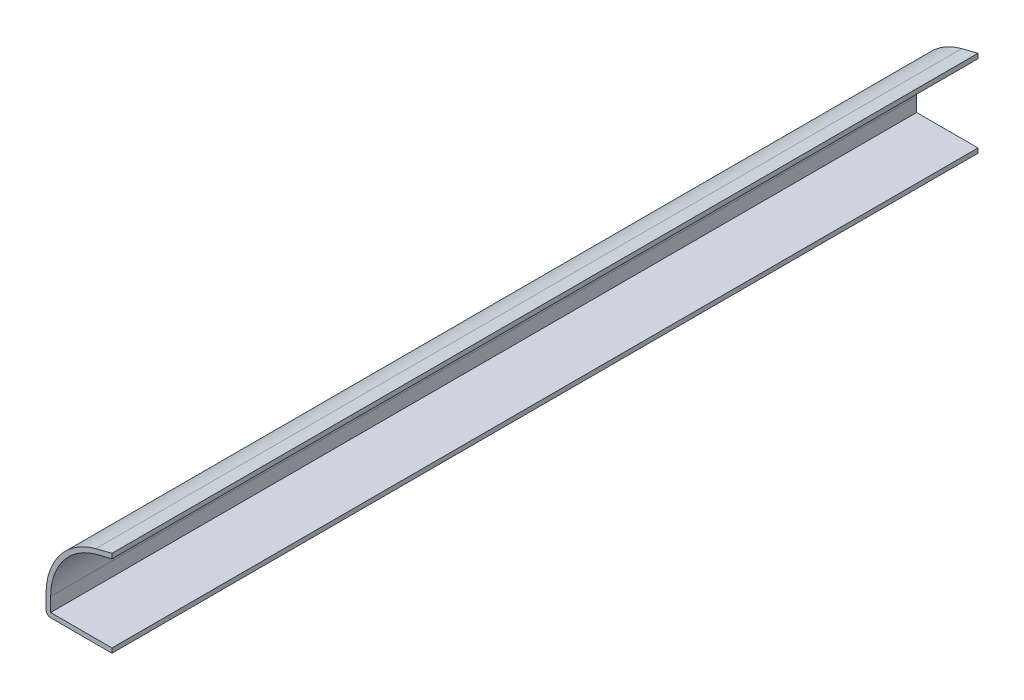
ISO-10303-21;
HEADER;
FILE_DESCRIPTION(('STEP AP214'),'2;1');
FILE_NAME('part.step','',(''),(''),'','','');
FILE_SCHEMA(('AUTOMOTIVE_DESIGN { 1 0 10303 214 1 1 1 1 }'));
ENDSEC;
DATA;
#1=APPLICATION_CONTEXT('core data for automotive mechanical design processes');
#2=APPLICATION_PROTOCOL_DEFINITION('international standard','automotive_design',2000,#1);
#3=PRODUCT_CONTEXT('',#1,'mechanical');
#4=PRODUCT('Part','Part','',(#3));
#5=PRODUCT_RELATED_PRODUCT_CATEGORY('part','',(#4));
#6=PRODUCT_DEFINITION_FORMATION('','',#4);
#7=PRODUCT_DEFINITION_CONTEXT('part definition',#1,'design');
#8=PRODUCT_DEFINITION('design','',#6,#7);
#9=PRODUCT_DEFINITION_SHAPE('','',#8);
#10=(LENGTH_UNIT() NAMED_UNIT(*) SI_UNIT(.MILLI.,.METRE.));
#11=(NAMED_UNIT(*) PLANE_ANGLE_UNIT() SI_UNIT($,.RADIAN.));
#12=(NAMED_UNIT(*) SI_UNIT($,.STERADIAN.) SOLID_ANGLE_UNIT());
#13=UNCERTAINTY_MEASURE_WITH_UNIT(LENGTH_MEASURE(1.E-05),#10,'distance_accuracy_value','');
#14=(GEOMETRIC_REPRESENTATION_CONTEXT(3) GLOBAL_UNCERTAINTY_ASSIGNED_CONTEXT((#13)) GLOBAL_UNIT_ASSIGNED_CONTEXT((#10,
#11,#12)) REPRESENTATION_CONTEXT('',''));
#15=CARTESIAN_POINT('',(0.,0.,0.));
#16=DIRECTION('',(0.,0.,1.));
#17=DIRECTION('',(1.,0.,0.));
#18=AXIS2_PLACEMENT_3D('',#15,#16,#17);
#19=CARTESIAN_POINT('',(-12.7,0.,-166.6875));
#20=DIRECTION('',(0.,-1.,0.));
#21=DIRECTION('',(0.,0.,-1.));
#22=AXIS2_PLACEMENT_3D('',#19,#20,#21);
#23=PLANE('',#22);
#24=DIRECTION('',(1.,0.,0.));
#25=VECTOR('',#24,1.);
#26=CARTESIAN_POINT('',(-12.7,0.,0.));
#27=LINE('',#26,#25);
#28=CARTESIAN_POINT('',(-11.811,0.,0.));
#29=VERTEX_POINT('',#28);
#30=CARTESIAN_POINT('',(0.,0.,0.));
#31=VERTEX_POINT('',#30);
#32=EDGE_CURVE('E187',#29,#31,#27,.T.);
#33=ORIENTED_EDGE('',*,*,#32,.F.);
#34=DIRECTION('',(0.,0.,1.));
#35=VECTOR('',#34,1.);
#36=CARTESIAN_POINT('',(-11.811,0.,-166.6875));
#37=LINE('',#36,#35);
#38=CARTESIAN_POINT('',(-11.811,0.,-166.6875));
#39=VERTEX_POINT('',#38);
#40=EDGE_CURVE('E60',#29,#39,#37,.F.);
#41=ORIENTED_EDGE('',*,*,#40,.T.);
#42=DIRECTION('',(1.,0.,0.));
#43=VECTOR('',#42,1.);
#44=CARTESIAN_POINT('',(-12.7,0.,-166.6875));
#45=LINE('',#44,#43);
#46=CARTESIAN_POINT('',(0.,0.,-166.6875));
#47=VERTEX_POINT('',#46);
#48=EDGE_CURVE('E176',#39,#47,#45,.T.);
#49=ORIENTED_EDGE('',*,*,#48,.T.);
#50=DIRECTION('',(0.,0.,1.));
#51=VECTOR('',#50,1.);
#52=CARTESIAN_POINT('',(0.,0.,-166.6875));
#53=LINE('',#52,#51);
#54=EDGE_CURVE('E161',#47,#31,#53,.T.);
#55=ORIENTED_EDGE('',*,*,#54,.T.);
#56=EDGE_LOOP('',(#33,#41,#49,#55));
#57=FACE_BOUND('',#56,.T.);
#58=ADVANCED_FACE('F37',(#57),#23,.T.);
#59=CARTESIAN_POINT('',(-12.7,0.,-166.6875));
#60=DIRECTION('',(-1.,0.,0.));
#61=DIRECTION('',(0.,0.,1.));
#62=AXIS2_PLACEMENT_3D('',#59,#60,#61);
#63=PLANE('',#62);
#64=DIRECTION('',(0.,-1.,0.));
#65=VECTOR('',#64,1.);
#66=CARTESIAN_POINT('',(-12.7,0.,-166.6875));
#67=LINE('',#66,#65);
#68=CARTESIAN_POINT('',(-12.7,3.56567534134419,-166.6875));
#69=VERTEX_POINT('',#68);
#70=CARTESIAN_POINT('',(-12.7,0.889,-166.6875));
#71=VERTEX_POINT('',#70);
#72=EDGE_CURVE('E164',#69,#71,#67,.T.);
#73=ORIENTED_EDGE('',*,*,#72,.T.);
#74=DIRECTION('',(0.,0.,1.));
#75=VECTOR('',#74,1.);
#76=CARTESIAN_POINT('',(-12.7,0.889,-166.6875));
#77=LINE('',#76,#75);
#78=CARTESIAN_POINT('',(-12.7,0.889,0.));
#79=VERTEX_POINT('',#78);
#80=EDGE_CURVE('E165',#71,#79,#77,.T.);
#81=ORIENTED_EDGE('',*,*,#80,.T.);
#82=DIRECTION('',(0.,-1.,0.));
#83=VECTOR('',#82,1.);
#84=CARTESIAN_POINT('',(-12.7,0.,0.));
#85=LINE('',#84,#83);
#86=CARTESIAN_POINT('',(-12.7,3.56567534134419,0.));
#87=VERTEX_POINT('',#86);
#88=EDGE_CURVE('E189',#87,#79,#85,.T.);
#89=ORIENTED_EDGE('',*,*,#88,.F.);
#90=DIRECTION('',(0.,0.,1.));
#91=VECTOR('',#90,1.);
#92=CARTESIAN_POINT('',(-12.7,3.56567534134419,-166.6875));
#93=LINE('',#92,#91);
#94=EDGE_CURVE('E147',#69,#87,#93,.T.);
#95=ORIENTED_EDGE('',*,*,#94,.F.);
#96=EDGE_LOOP('',(#73,#81,#89,#95));
#97=FACE_BOUND('',#96,.T.);
#98=ADVANCED_FACE('F180',(#97),#63,.T.);
#99=CARTESIAN_POINT('',(0.,3.56567534134419,-166.6875));
#100=DIRECTION('',(0.,0.,1.));
#101=DIRECTION('',(1.,0.,0.));
#102=AXIS2_PLACEMENT_3D('',#99,#100,#101);
#103=CYLINDRICAL_SURFACE('',#102,12.7);
#104=CARTESIAN_POINT('',(0.,3.56567534134419,0.));
#105=DIRECTION('',(0.,0.,1.));
#106=DIRECTION('',(1.,0.,0.));
#107=AXIS2_PLACEMENT_3D('',#104,#105,#106);
#108=CIRCLE('',#107,12.7);
#109=CARTESIAN_POINT('',(-3.12578413327089,15.875,0.));
#110=VERTEX_POINT('',#109);
#111=EDGE_CURVE('E204',#110,#87,#108,.T.);
#112=ORIENTED_EDGE('',*,*,#111,.F.);
#113=DIRECTION('',(0.,0.,1.));
#114=VECTOR('',#113,1.);
#115=CARTESIAN_POINT('',(-3.12578413327089,15.875,-166.6875));
#116=LINE('',#115,#114);
#117=CARTESIAN_POINT('',(-3.12578413327089,15.875,-166.6875));
#118=VERTEX_POINT('',#117);
#119=EDGE_CURVE('E144',#118,#110,#116,.T.);
#120=ORIENTED_EDGE('',*,*,#119,.F.);
#121=CARTESIAN_POINT('',(0.,3.56567534134419,-166.6875));
#122=DIRECTION('',(0.,0.,1.));
#123=DIRECTION('',(1.,0.,0.));
#124=AXIS2_PLACEMENT_3D('',#121,#122,#123);
#125=CIRCLE('',#124,12.7);
#126=EDGE_CURVE('E184',#118,#69,#125,.T.);
#127=ORIENTED_EDGE('',*,*,#126,.T.);
#128=ORIENTED_EDGE('',*,*,#94,.T.);
#129=EDGE_LOOP('',(#112,#120,#127,#128));
#130=FACE_BOUND('',#129,.T.);
#131=ADVANCED_FACE('F208',(#130),#103,.T.);
#132=CARTESIAN_POINT('',(0.,16.66875,-166.6875));
#133=DIRECTION('',(-0.24612473490322,0.969238162098883,0.));
#134=DIRECTION('',(-0.969238162098883,-0.24612473490322,0.));
#135=AXIS2_PLACEMENT_3D('',#132,#133,#134);
#136=PLANE('',#135);
#137=DIRECTION('',(-0.969238162098883,-0.24612473490322,0.));
#138=VECTOR('',#137,1.);
#139=CARTESIAN_POINT('',(0.,16.66875,0.));
#140=LINE('',#139,#138);
#141=CARTESIAN_POINT('',(0.,16.66875,0.));
#142=VERTEX_POINT('',#141);
#143=EDGE_CURVE('E131',#142,#110,#140,.T.);
#144=ORIENTED_EDGE('',*,*,#143,.F.);
#145=DIRECTION('',(0.,0.,1.));
#146=VECTOR('',#145,1.);
#147=CARTESIAN_POINT('',(0.,16.66875,-166.6875));
#148=LINE('',#147,#146);
#149=CARTESIAN_POINT('',(0.,16.66875,-166.6875));
#150=VERTEX_POINT('',#149);
#151=EDGE_CURVE('E141',#150,#142,#148,.T.);
#152=ORIENTED_EDGE('',*,*,#151,.F.);
#153=DIRECTION('',(-0.969238162098883,-0.24612473490322,0.));
#154=VECTOR('',#153,1.);
#155=CARTESIAN_POINT('',(0.,16.66875,-166.6875));
#156=LINE('',#155,#154);
#157=EDGE_CURVE('E210',#150,#118,#156,.T.);
#158=ORIENTED_EDGE('',*,*,#157,.T.);
#159=ORIENTED_EDGE('',*,*,#119,.T.);
#160=EDGE_LOOP('',(#144,#152,#158,#159));
#161=FACE_BOUND('',#160,.T.);
#162=ADVANCED_FACE('F209',(#161),#136,.T.);
#163=CARTESIAN_POINT('',(0.218804889328962,15.8070972738941,-166.6875));
#164=DIRECTION('',(-0.24612473490322,0.969238162098883,0.));
#165=DIRECTION('',(-0.969238162098883,-0.24612473490322,0.));
#166=AXIS2_PLACEMENT_3D('',#163,#164,#165);
#167=PLANE('',#166);
#168=DIRECTION('',(-0.969238162098883,-0.24612473490322,0.));
#169=VECTOR('',#168,1.);
#170=CARTESIAN_POINT('',(0.218804889328962,15.8070972738941,-166.6875));
#171=LINE('',#170,#169);
#172=CARTESIAN_POINT('',(0.,15.7515347738941,-166.6875));
#173=VERTEX_POINT('',#172);
#174=CARTESIAN_POINT('',(-2.90697924394193,15.0133472738941,-166.6875));
#175=VERTEX_POINT('',#174);
#176=EDGE_CURVE('E136',#173,#175,#171,.T.);
#177=ORIENTED_EDGE('',*,*,#176,.F.);
#178=DIRECTION('',(0.,0.,1.));
#179=VECTOR('',#178,1.);
#180=CARTESIAN_POINT('',(0.,15.7515347738941,-166.6875));
#181=LINE('',#180,#179);
#182=CARTESIAN_POINT('',(0.,15.7515347738941,0.));
#183=VERTEX_POINT('',#182);
#184=EDGE_CURVE('E134',#173,#183,#181,.T.);
#185=ORIENTED_EDGE('',*,*,#184,.T.);
#186=DIRECTION('',(-0.969238162098883,-0.24612473490322,0.));
#187=VECTOR('',#186,1.);
#188=CARTESIAN_POINT('',(0.218804889328962,15.8070972738941,0.));
#189=LINE('',#188,#187);
#190=CARTESIAN_POINT('',(-2.90697924394193,15.0133472738941,0.));
#191=VERTEX_POINT('',#190);
#192=EDGE_CURVE('E121',#183,#191,#189,.T.);
#193=ORIENTED_EDGE('',*,*,#192,.T.);
#194=DIRECTION('',(0.,0.,1.));
#195=VECTOR('',#194,1.);
#196=CARTESIAN_POINT('',(-2.90697924394193,15.0133472738941,-166.6875));
#197=LINE('',#196,#195);
#198=EDGE_CURVE('E145',#175,#191,#197,.T.);
#199=ORIENTED_EDGE('',*,*,#198,.F.);
#200=EDGE_LOOP('',(#177,#185,#193,#199));
#201=FACE_BOUND('',#200,.T.);
#202=ADVANCED_FACE('F135',(#201),#167,.F.);
#203=CARTESIAN_POINT('',(0.,3.56567534134419,-166.6875));
#204=DIRECTION('',(0.,0.,1.));
#205=DIRECTION('',(1.,0.,0.));
#206=AXIS2_PLACEMENT_3D('',#203,#204,#205);
#207=CYLINDRICAL_SURFACE('',#206,11.811);
#208=CARTESIAN_POINT('',(0.,3.56567534134419,0.));
#209=DIRECTION('',(0.,0.,1.));
#210=DIRECTION('',(1.,0.,0.));
#211=AXIS2_PLACEMENT_3D('',#208,#209,#210);
#212=CIRCLE('',#211,11.811);
#213=CARTESIAN_POINT('',(-11.811,3.56567534134419,0.));
#214=VERTEX_POINT('',#213);
#215=EDGE_CURVE('E127',#191,#214,#212,.T.);
#216=ORIENTED_EDGE('',*,*,#215,.T.);
#217=DIRECTION('',(0.,0.,1.));
#218=VECTOR('',#217,1.);
#219=CARTESIAN_POINT('',(-11.811,3.56567534134419,-166.6875));
#220=LINE('',#219,#218);
#221=CARTESIAN_POINT('',(-11.811,3.56567534134419,-166.6875));
#222=VERTEX_POINT('',#221);
#223=EDGE_CURVE('E149',#222,#214,#220,.T.);
#224=ORIENTED_EDGE('',*,*,#223,.F.);
#225=CARTESIAN_POINT('',(0.,3.56567534134419,-166.6875));
#226=DIRECTION('',(0.,0.,1.));
#227=DIRECTION('',(1.,0.,0.));
#228=AXIS2_PLACEMENT_3D('',#225,#226,#227);
#229=CIRCLE('',#228,11.811);
#230=EDGE_CURVE('E214',#175,#222,#229,.T.);
#231=ORIENTED_EDGE('',*,*,#230,.F.);
#232=ORIENTED_EDGE('',*,*,#198,.T.);
#233=EDGE_LOOP('',(#216,#224,#231,#232));
#234=FACE_BOUND('',#233,.T.);
#235=ADVANCED_FACE('F237',(#234),#207,.F.);
#236=CARTESIAN_POINT('',(-11.811,0.,-166.6875));
#237=DIRECTION('',(-1.,0.,0.));
#238=DIRECTION('',(0.,0.,1.));
#239=AXIS2_PLACEMENT_3D('',#236,#237,#238);
#240=PLANE('',#239);
#241=DIRECTION('',(0.,1.,0.));
#242=VECTOR('',#241,1.);
#243=CARTESIAN_POINT('',(-11.811,0.,0.));
#244=LINE('',#243,#242);
#245=CARTESIAN_POINT('',(-11.811,0.889,0.));
#246=VERTEX_POINT('',#245);
#247=EDGE_CURVE('E200',#214,#246,#244,.F.);
#248=ORIENTED_EDGE('',*,*,#247,.T.);
#249=DIRECTION('',(0.,0.,1.));
#250=VECTOR('',#249,1.);
#251=CARTESIAN_POINT('',(-11.811,0.889,-166.6875));
#252=LINE('',#251,#250);
#253=CARTESIAN_POINT('',(-11.811,0.889,-166.6875));
#254=VERTEX_POINT('',#253);
#255=EDGE_CURVE('E155',#254,#246,#252,.T.);
#256=ORIENTED_EDGE('',*,*,#255,.F.);
#257=DIRECTION('',(0.,1.,0.));
#258=VECTOR('',#257,1.);
#259=CARTESIAN_POINT('',(-11.811,0.,-166.6875));
#260=LINE('',#259,#258);
#261=EDGE_CURVE('E216',#222,#254,#260,.F.);
#262=ORIENTED_EDGE('',*,*,#261,.F.);
#263=ORIENTED_EDGE('',*,*,#223,.T.);
#264=EDGE_LOOP('',(#248,#256,#262,#263));
#265=FACE_BOUND('',#264,.T.);
#266=ADVANCED_FACE('F233',(#265),#240,.F.);
#267=CARTESIAN_POINT('',(-12.7,0.889,-166.6875));
#268=DIRECTION('',(0.,-1.,0.));
#269=DIRECTION('',(0.,0.,-1.));
#270=AXIS2_PLACEMENT_3D('',#267,#268,#269);
#271=PLANE('',#270);
#272=DIRECTION('',(1.,0.,0.));
#273=VECTOR('',#272,1.);
#274=CARTESIAN_POINT('',(-12.7,0.889,0.));
#275=LINE('',#274,#273);
#276=CARTESIAN_POINT('',(0.,0.889,0.));
#277=VERTEX_POINT('',#276);
#278=EDGE_CURVE('E194',#246,#277,#275,.T.);
#279=ORIENTED_EDGE('',*,*,#278,.T.);
#280=DIRECTION('',(0.,0.,1.));
#281=VECTOR('',#280,1.);
#282=CARTESIAN_POINT('',(0.,0.889,-166.6875));
#283=LINE('',#282,#281);
#284=CARTESIAN_POINT('',(0.,0.889,-166.6875));
#285=VERTEX_POINT('',#284);
#286=EDGE_CURVE('E158',#285,#277,#283,.T.);
#287=ORIENTED_EDGE('',*,*,#286,.F.);
#288=DIRECTION('',(1.,0.,0.));
#289=VECTOR('',#288,1.);
#290=CARTESIAN_POINT('',(-12.7,0.889,-166.6875));
#291=LINE('',#290,#289);
#292=EDGE_CURVE('E218',#254,#285,#291,.T.);
#293=ORIENTED_EDGE('',*,*,#292,.F.);
#294=ORIENTED_EDGE('',*,*,#255,.T.);
#295=EDGE_LOOP('',(#279,#287,#293,#294));
#296=FACE_BOUND('',#295,.T.);
#297=ADVANCED_FACE('F229',(#296),#271,.F.);
#298=CARTESIAN_POINT('',(0.,0.889,-166.6875));
#299=DIRECTION('',(-1.,0.,0.));
#300=DIRECTION('',(0.,0.,1.));
#301=AXIS2_PLACEMENT_3D('',#298,#299,#300);
#302=PLANE('',#301);
#303=DIRECTION('',(0.,-1.,0.));
#304=VECTOR('',#303,1.);
#305=CARTESIAN_POINT('',(0.,0.889,0.));
#306=LINE('',#305,#304);
#307=EDGE_CURVE('E192',#277,#31,#306,.T.);
#308=ORIENTED_EDGE('',*,*,#307,.T.);
#309=ORIENTED_EDGE('',*,*,#54,.F.);
#310=DIRECTION('',(0.,-1.,0.));
#311=VECTOR('',#310,1.);
#312=CARTESIAN_POINT('',(0.,0.889,-166.6875));
#313=LINE('',#312,#311);
#314=EDGE_CURVE('E220',#285,#47,#313,.T.);
#315=ORIENTED_EDGE('',*,*,#314,.F.);
#316=ORIENTED_EDGE('',*,*,#286,.T.);
#317=EDGE_LOOP('',(#308,#309,#315,#316));
#318=FACE_BOUND('',#317,.T.);
#319=ADVANCED_FACE('F226',(#318),#302,.F.);
#320=CARTESIAN_POINT('',(0.,3.56567534134419,-166.6875));
#321=DIRECTION('',(0.,0.,1.));
#322=DIRECTION('',(1.,0.,0.));
#323=AXIS2_PLACEMENT_3D('',#320,#321,#322);
#324=PLANE('',#323);
#325=ORIENTED_EDGE('',*,*,#157,.F.);
#326=DIRECTION('',(0.,-1.,0.));
#327=VECTOR('',#326,1.);
#328=CARTESIAN_POINT('',(0.,3.56567534134419,-166.6875));
#329=LINE('',#328,#327);
#330=EDGE_CURVE('E52',#150,#173,#329,.T.);
#331=ORIENTED_EDGE('',*,*,#330,.T.);
#332=ORIENTED_EDGE('',*,*,#176,.T.);
#333=ORIENTED_EDGE('',*,*,#230,.T.);
#334=ORIENTED_EDGE('',*,*,#261,.T.);
#335=ORIENTED_EDGE('',*,*,#292,.T.);
#336=ORIENTED_EDGE('',*,*,#314,.T.);
#337=ORIENTED_EDGE('',*,*,#48,.F.);
#338=CARTESIAN_POINT('',(-11.811,0.889,-166.6875));
#339=DIRECTION('',(0.,0.,1.));
#340=DIRECTION('',(1.,0.,0.));
#341=AXIS2_PLACEMENT_3D('',#338,#339,#340);
#342=CIRCLE('',#341,0.889);
#343=EDGE_CURVE('E45',#39,#71,#342,.F.);
#344=ORIENTED_EDGE('',*,*,#343,.T.);
#345=ORIENTED_EDGE('',*,*,#72,.F.);
#346=ORIENTED_EDGE('',*,*,#126,.F.);
#347=EDGE_LOOP('',(#325,#331,#332,#333,#334,#335,#336,#337,#344,#345,#346));
#348=FACE_BOUND('',#347,.T.);
#349=ADVANCED_FACE('F173',(#348),#324,.F.);
#350=CARTESIAN_POINT('',(0.,3.56567534134419,0.));
#351=DIRECTION('',(0.,0.,1.));
#352=DIRECTION('',(1.,0.,0.));
#353=AXIS2_PLACEMENT_3D('',#350,#351,#352);
#354=PLANE('',#353);
#355=DIRECTION('',(0.,-1.,0.));
#356=VECTOR('',#355,1.);
#357=CARTESIAN_POINT('',(0.,3.56567534134419,0.));
#358=LINE('',#357,#356);
#359=EDGE_CURVE('E11',#142,#183,#358,.T.);
#360=ORIENTED_EDGE('',*,*,#359,.F.);
#361=ORIENTED_EDGE('',*,*,#143,.T.);
#362=ORIENTED_EDGE('',*,*,#111,.T.);
#363=ORIENTED_EDGE('',*,*,#88,.T.);
#364=CARTESIAN_POINT('',(-11.811,0.889,0.));
#365=DIRECTION('',(0.,0.,1.));
#366=DIRECTION('',(1.,0.,0.));
#367=AXIS2_PLACEMENT_3D('',#364,#365,#366);
#368=CIRCLE('',#367,0.889);
#369=EDGE_CURVE('E168',#79,#29,#368,.T.);
#370=ORIENTED_EDGE('',*,*,#369,.T.);
#371=ORIENTED_EDGE('',*,*,#32,.T.);
#372=ORIENTED_EDGE('',*,*,#307,.F.);
#373=ORIENTED_EDGE('',*,*,#278,.F.);
#374=ORIENTED_EDGE('',*,*,#247,.F.);
#375=ORIENTED_EDGE('',*,*,#215,.F.);
#376=ORIENTED_EDGE('',*,*,#192,.F.);
#377=EDGE_LOOP('',(#360,#361,#362,#363,#370,#371,#372,#373,#374,#375,#376));
#378=FACE_BOUND('',#377,.T.);
#379=ADVANCED_FACE('F123',(#378),#354,.T.);
#380=CARTESIAN_POINT('',(-11.811,0.889,-166.6875));
#381=DIRECTION('',(0.,0.,1.));
#382=DIRECTION('',(1.,0.,0.));
#383=AXIS2_PLACEMENT_3D('',#380,#381,#382);
#384=CYLINDRICAL_SURFACE('',#383,0.889);
#385=ORIENTED_EDGE('',*,*,#343,.F.);
#386=ORIENTED_EDGE('',*,*,#40,.F.);
#387=ORIENTED_EDGE('',*,*,#369,.F.);
#388=ORIENTED_EDGE('',*,*,#80,.F.);
#389=EDGE_LOOP('',(#385,#386,#387,#388));
#390=FACE_BOUND('',#389,.T.);
#391=ADVANCED_FACE('F39',(#390),#384,.T.);
#392=CARTESIAN_POINT('',(0.,0.889,210.020331614663));
#393=DIRECTION('',(-1.,0.,0.));
#394=DIRECTION('',(0.,0.,1.));
#395=AXIS2_PLACEMENT_3D('',#392,#393,#394);
#396=PLANE('',#395);
#397=ORIENTED_EDGE('',*,*,#330,.F.);
#398=ORIENTED_EDGE('',*,*,#151,.T.);
#399=ORIENTED_EDGE('',*,*,#359,.T.);
#400=ORIENTED_EDGE('',*,*,#184,.F.);
#401=EDGE_LOOP('',(#397,#398,#399,#400));
#402=FACE_BOUND('',#401,.T.);
#403=ADVANCED_FACE('F140',(#402),#396,.F.);
#404=CLOSED_SHELL('',(#58,#98,#131,#162,#202,#235,#266,#297,#319,#349,#379,#391,#403));
#405=MANIFOLD_SOLID_BREP('B2',#404);
#406=ADVANCED_BREP_SHAPE_REPRESENTATION('',(#18,#405),#14);
#407=SHAPE_DEFINITION_REPRESENTATION(#9,#406);
ENDSEC;
END-ISO-10303-21;
